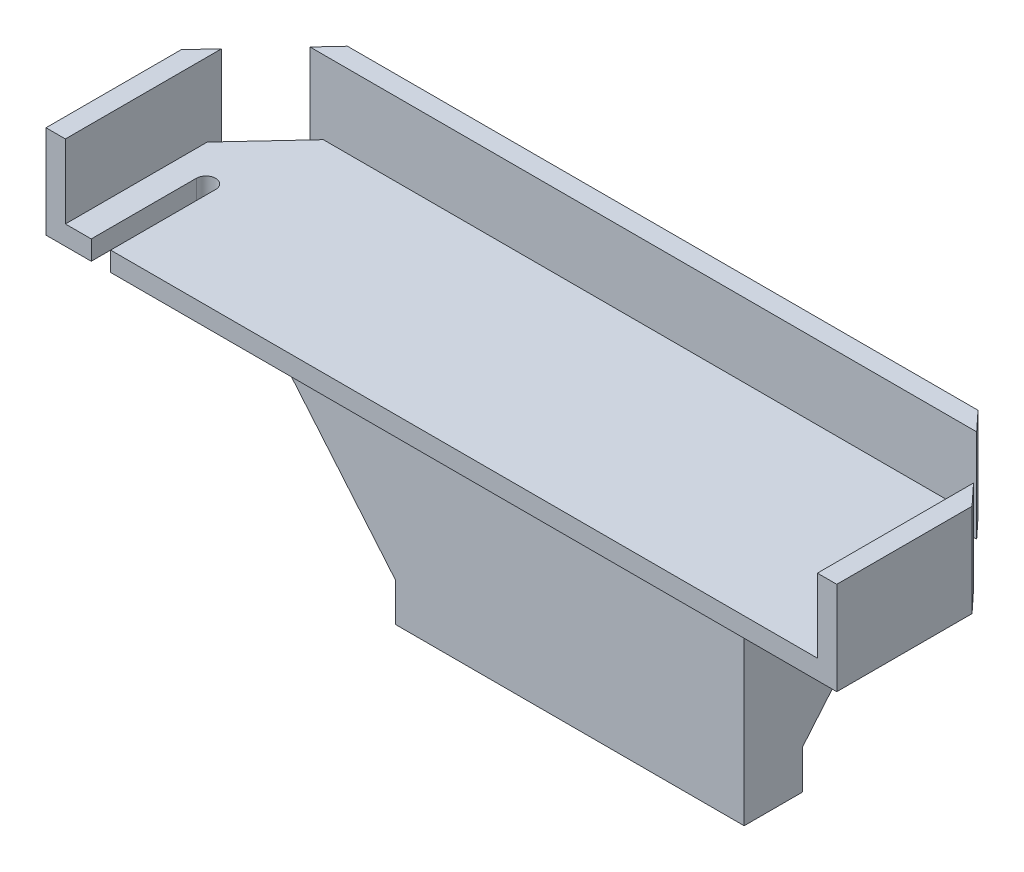
ISO-10303-21;
HEADER;
FILE_DESCRIPTION(('STEP AP214'),'2;1');
FILE_NAME('part.step','',(''),(''),'','','');
FILE_SCHEMA(('AUTOMOTIVE_DESIGN { 1 0 10303 214 1 1 1 1 }'));
ENDSEC;
DATA;
#1=APPLICATION_CONTEXT('core data for automotive mechanical design processes');
#2=APPLICATION_PROTOCOL_DEFINITION('international standard','automotive_design',2000,#1);
#3=PRODUCT_CONTEXT('',#1,'mechanical');
#4=PRODUCT('Part','Part','',(#3));
#5=PRODUCT_RELATED_PRODUCT_CATEGORY('part','',(#4));
#6=PRODUCT_DEFINITION_FORMATION('','',#4);
#7=PRODUCT_DEFINITION_CONTEXT('part definition',#1,'design');
#8=PRODUCT_DEFINITION('design','',#6,#7);
#9=PRODUCT_DEFINITION_SHAPE('','',#8);
#10=(LENGTH_UNIT() NAMED_UNIT(*) SI_UNIT(.MILLI.,.METRE.));
#11=(NAMED_UNIT(*) PLANE_ANGLE_UNIT() SI_UNIT($,.RADIAN.));
#12=(NAMED_UNIT(*) SI_UNIT($,.STERADIAN.) SOLID_ANGLE_UNIT());
#13=UNCERTAINTY_MEASURE_WITH_UNIT(LENGTH_MEASURE(1.E-05),#10,'distance_accuracy_value','');
#14=(GEOMETRIC_REPRESENTATION_CONTEXT(3) GLOBAL_UNCERTAINTY_ASSIGNED_CONTEXT((#13)) GLOBAL_UNIT_ASSIGNED_CONTEXT((#10,
#11,#12)) REPRESENTATION_CONTEXT('',''));
#15=CARTESIAN_POINT('',(0.,0.,0.));
#16=DIRECTION('',(0.,0.,1.));
#17=DIRECTION('',(1.,0.,0.));
#18=AXIS2_PLACEMENT_3D('',#15,#16,#17);
#19=CARTESIAN_POINT('',(0.,13.8,0.));
#20=DIRECTION('',(0.,-1.,0.));
#21=DIRECTION('',(0.,0.,-1.));
#22=AXIS2_PLACEMENT_3D('',#19,#20,#21);
#23=PLANE('',#22);
#24=DIRECTION('',(0.,0.,1.));
#25=VECTOR('',#24,1.);
#26=CARTESIAN_POINT('',(-20.4,13.8,-4.85803199153785));
#27=LINE('',#26,#25);
#28=CARTESIAN_POINT('',(-20.4,13.8,-4.85803199153785));
#29=VERTEX_POINT('',#28);
#30=CARTESIAN_POINT('',(-20.4,13.8,2.12010259286792));
#31=VERTEX_POINT('',#30);
#32=EDGE_CURVE('E283',#29,#31,#27,.T.);
#33=ORIENTED_EDGE('',*,*,#32,.T.);
#34=DIRECTION('',(-1.,0.,0.));
#35=VECTOR('',#34,1.);
#36=CARTESIAN_POINT('',(-20.4,13.8,2.12010259286792));
#37=LINE('',#36,#35);
#38=CARTESIAN_POINT('',(-19.4,13.8,2.12010259286792));
#39=VERTEX_POINT('',#38);
#40=EDGE_CURVE('E242',#39,#31,#37,.T.);
#41=ORIENTED_EDGE('',*,*,#40,.F.);
#42=DIRECTION('',(0.,0.,1.));
#43=VECTOR('',#42,1.);
#44=CARTESIAN_POINT('',(-19.4,13.8,0.));
#45=LINE('',#44,#43);
#46=CARTESIAN_POINT('',(-19.4,13.8,-5.93234821689864));
#47=VERTEX_POINT('',#46);
#48=EDGE_CURVE('E432',#47,#39,#45,.T.);
#49=ORIENTED_EDGE('',*,*,#48,.F.);
#50=DIRECTION('',(-0.681336240562654,0.,0.731970578162777));
#51=VECTOR('',#50,1.);
#52=CARTESIAN_POINT('',(-16.2653067843498,13.8,-9.3));
#53=LINE('',#52,#51);
#54=EDGE_CURVE('E454',#47,#29,#53,.T.);
#55=ORIENTED_EDGE('',*,*,#54,.T.);
#56=EDGE_LOOP('',(#33,#41,#49,#55));
#57=FACE_BOUND('',#56,.T.);
#58=ADVANCED_FACE('F63',(#57),#23,.F.);
#59=CARTESIAN_POINT('',(-16.2653067843498,13.8,-9.3));
#60=VERTEX_POINT('',#59);
#61=CARTESIAN_POINT('',(-17.1961314115811,13.8,-8.3));
#62=VERTEX_POINT('',#61);
#63=EDGE_CURVE('E455',#60,#62,#53,.T.);
#64=ORIENTED_EDGE('',*,*,#63,.T.);
#65=DIRECTION('',(-1.,0.,0.));
#66=VECTOR('',#65,1.);
#67=CARTESIAN_POINT('',(0.,13.8,-8.3));
#68=LINE('',#67,#66);
#69=CARTESIAN_POINT('',(17.1961314115811,13.8,-8.30000000000001));
#70=VERTEX_POINT('',#69);
#71=EDGE_CURVE('E436',#70,#62,#68,.T.);
#72=ORIENTED_EDGE('',*,*,#71,.F.);
#73=DIRECTION('',(-0.681336240562654,0.,-0.731970578162776));
#74=VECTOR('',#73,1.);
#75=CARTESIAN_POINT('',(16.2653067843498,13.8,-9.30000000000001));
#76=LINE('',#75,#74);
#77=CARTESIAN_POINT('',(16.2653067843498,13.8,-9.30000000000001));
#78=VERTEX_POINT('',#77);
#79=EDGE_CURVE('E273',#70,#78,#76,.T.);
#80=ORIENTED_EDGE('',*,*,#79,.T.);
#81=DIRECTION('',(-1.,0.,0.));
#82=VECTOR('',#81,1.);
#83=CARTESIAN_POINT('',(-16.2653067843498,13.8,-9.3));
#84=LINE('',#83,#82);
#85=EDGE_CURVE('E451',#78,#60,#84,.T.);
#86=ORIENTED_EDGE('',*,*,#85,.T.);
#87=EDGE_LOOP('',(#64,#72,#80,#86));
#88=FACE_BOUND('',#87,.T.);
#89=ADVANCED_FACE('F386',(#88),#23,.F.);
#90=CARTESIAN_POINT('',(16.2653067843498,13.8,-9.30000000000001));
#91=DIRECTION('',(-0.731970578162776,0.,0.681336240562654));
#92=DIRECTION('',(0.681336240562654,0.,0.731970578162777));
#93=AXIS2_PLACEMENT_3D('',#90,#91,#92);
#94=PLANE('',#93);
#95=ORIENTED_EDGE('',*,*,#79,.F.);
#96=DIRECTION('',(0.,-1.,0.));
#97=VECTOR('',#96,1.);
#98=CARTESIAN_POINT('',(17.1961314115811,13.8,-8.30000000000001));
#99=LINE('',#98,#97);
#100=CARTESIAN_POINT('',(17.1961314115811,9.,-8.30000000000001));
#101=VERTEX_POINT('',#100);
#102=EDGE_CURVE('E502',#70,#101,#99,.T.);
#103=ORIENTED_EDGE('',*,*,#102,.T.);
#104=DIRECTION('',(-0.681336240562654,0.,-0.731970578162776));
#105=VECTOR('',#104,1.);
#106=CARTESIAN_POINT('',(16.2653067843498,9.,-9.30000000000001));
#107=LINE('',#106,#105);
#108=CARTESIAN_POINT('',(16.2653067843498,9.,-9.30000000000001));
#109=VERTEX_POINT('',#108);
#110=EDGE_CURVE('E463',#101,#109,#107,.T.);
#111=ORIENTED_EDGE('',*,*,#110,.T.);
#112=DIRECTION('',(0.,-1.,0.));
#113=VECTOR('',#112,1.);
#114=CARTESIAN_POINT('',(16.2653067843498,13.8,-9.30000000000001));
#115=LINE('',#114,#113);
#116=EDGE_CURVE('E287',#78,#109,#115,.T.);
#117=ORIENTED_EDGE('',*,*,#116,.F.);
#118=EDGE_LOOP('',(#95,#103,#111,#117));
#119=FACE_BOUND('',#118,.T.);
#120=ADVANCED_FACE('F380',(#119),#94,.F.);
#121=CARTESIAN_POINT('',(-16.2653067843498,13.8,-9.3));
#122=DIRECTION('',(0.731970578162777,0.,0.681336240562654));
#123=DIRECTION('',(0.681336240562654,0.,-0.731970578162777));
#124=AXIS2_PLACEMENT_3D('',#121,#122,#123);
#125=PLANE('',#124);
#126=ORIENTED_EDGE('',*,*,#54,.F.);
#127=DIRECTION('',(0.,-1.,0.));
#128=VECTOR('',#127,1.);
#129=CARTESIAN_POINT('',(-19.4,13.8,-5.93234821689864));
#130=LINE('',#129,#128);
#131=CARTESIAN_POINT('',(-19.4,9.,-5.93234821689864));
#132=VERTEX_POINT('',#131);
#133=EDGE_CURVE('E480',#47,#132,#130,.T.);
#134=ORIENTED_EDGE('',*,*,#133,.T.);
#135=DIRECTION('',(-0.681336240562654,0.,0.731970578162777));
#136=VECTOR('',#135,1.);
#137=CARTESIAN_POINT('',(-16.2653067843498,9.,-9.3));
#138=LINE('',#137,#136);
#139=CARTESIAN_POINT('',(-20.4,9.,-4.85803199153785));
#140=VERTEX_POINT('',#139);
#141=EDGE_CURVE('E276',#132,#140,#138,.T.);
#142=ORIENTED_EDGE('',*,*,#141,.T.);
#143=DIRECTION('',(0.,-1.,0.));
#144=VECTOR('',#143,1.);
#145=CARTESIAN_POINT('',(-20.4,13.8,-4.85803199153785));
#146=LINE('',#145,#144);
#147=EDGE_CURVE('E265',#29,#140,#146,.T.);
#148=ORIENTED_EDGE('',*,*,#147,.F.);
#149=EDGE_LOOP('',(#126,#134,#142,#148));
#150=FACE_BOUND('',#149,.T.);
#151=ADVANCED_FACE('F478',(#150),#125,.F.);
#152=CARTESIAN_POINT('',(20.4,13.8,-4.85803199153786));
#153=DIRECTION('',(-1.,0.,0.));
#154=DIRECTION('',(0.,0.,1.));
#155=AXIS2_PLACEMENT_3D('',#152,#153,#154);
#156=PLANE('',#155);
#157=DIRECTION('',(0.,0.,-1.));
#158=VECTOR('',#157,1.);
#159=CARTESIAN_POINT('',(20.4,13.8,-4.85803199153786));
#160=LINE('',#159,#158);
#161=CARTESIAN_POINT('',(20.4,13.8,2.12010259286792));
#162=VERTEX_POINT('',#161);
#163=CARTESIAN_POINT('',(20.4,13.8,-4.85803199153786));
#164=VERTEX_POINT('',#163);
#165=EDGE_CURVE('E267',#162,#164,#160,.T.);
#166=ORIENTED_EDGE('',*,*,#165,.F.);
#167=DIRECTION('',(0.,1.,0.));
#168=VECTOR('',#167,1.);
#169=CARTESIAN_POINT('',(20.4,9.,2.12010259286792));
#170=LINE('',#169,#168);
#171=CARTESIAN_POINT('',(20.4,9.,2.12010259286792));
#172=VERTEX_POINT('',#171);
#173=EDGE_CURVE('E260',#172,#162,#170,.T.);
#174=ORIENTED_EDGE('',*,*,#173,.F.);
#175=DIRECTION('',(0.,0.,-1.));
#176=VECTOR('',#175,1.);
#177=CARTESIAN_POINT('',(20.4,9.,-4.85803199153786));
#178=LINE('',#177,#176);
#179=CARTESIAN_POINT('',(20.4,9.,-4.85803199153786));
#180=VERTEX_POINT('',#179);
#181=EDGE_CURVE('E423',#172,#180,#178,.T.);
#182=ORIENTED_EDGE('',*,*,#181,.T.);
#183=DIRECTION('',(0.,-1.,0.));
#184=VECTOR('',#183,1.);
#185=CARTESIAN_POINT('',(20.4,13.8,-4.85803199153786));
#186=LINE('',#185,#184);
#187=EDGE_CURVE('E291',#164,#180,#186,.T.);
#188=ORIENTED_EDGE('',*,*,#187,.F.);
#189=EDGE_LOOP('',(#166,#174,#182,#188));
#190=FACE_BOUND('',#189,.T.);
#191=ADVANCED_FACE('F402',(#190),#156,.F.);
#192=CARTESIAN_POINT('',(-20.4,13.8,-4.85803199153785));
#193=DIRECTION('',(1.,0.,0.));
#194=DIRECTION('',(0.,0.,-1.));
#195=AXIS2_PLACEMENT_3D('',#192,#193,#194);
#196=PLANE('',#195);
#197=DIRECTION('',(0.,0.,1.));
#198=VECTOR('',#197,1.);
#199=CARTESIAN_POINT('',(-20.4,9.,-4.85803199153785));
#200=LINE('',#199,#198);
#201=CARTESIAN_POINT('',(-20.4,9.,2.12010259286792));
#202=VERTEX_POINT('',#201);
#203=EDGE_CURVE('E256',#140,#202,#200,.T.);
#204=ORIENTED_EDGE('',*,*,#203,.T.);
#205=DIRECTION('',(0.,-1.,0.));
#206=VECTOR('',#205,1.);
#207=CARTESIAN_POINT('',(-20.4,9.,2.12010259286792));
#208=LINE('',#207,#206);
#209=EDGE_CURVE('E236',#31,#202,#208,.T.);
#210=ORIENTED_EDGE('',*,*,#209,.F.);
#211=ORIENTED_EDGE('',*,*,#32,.F.);
#212=ORIENTED_EDGE('',*,*,#147,.T.);
#213=EDGE_LOOP('',(#204,#210,#211,#212));
#214=FACE_BOUND('',#213,.T.);
#215=ADVANCED_FACE('F263',(#214),#196,.F.);
#216=DIRECTION('',(0.,0.,1.));
#217=VECTOR('',#216,1.);
#218=CARTESIAN_POINT('',(19.4,13.8,0.));
#219=LINE('',#218,#217);
#220=CARTESIAN_POINT('',(19.4,13.8,-5.93234821689864));
#221=VERTEX_POINT('',#220);
#222=CARTESIAN_POINT('',(19.4,13.8,2.12010259286792));
#223=VERTEX_POINT('',#222);
#224=EDGE_CURVE('E407',#221,#223,#219,.T.);
#225=ORIENTED_EDGE('',*,*,#224,.T.);
#226=EDGE_CURVE('E408',#162,#223,#37,.T.);
#227=ORIENTED_EDGE('',*,*,#226,.F.);
#228=ORIENTED_EDGE('',*,*,#165,.T.);
#229=EDGE_CURVE('E411',#164,#221,#76,.T.);
#230=ORIENTED_EDGE('',*,*,#229,.T.);
#231=EDGE_LOOP('',(#225,#227,#228,#230));
#232=FACE_BOUND('',#231,.T.);
#233=ADVANCED_FACE('F389',(#232),#23,.F.);
#234=CARTESIAN_POINT('',(0.,9.,0.));
#235=DIRECTION('',(0.,-1.,0.));
#236=DIRECTION('',(0.,0.,-1.));
#237=AXIS2_PLACEMENT_3D('',#234,#235,#236);
#238=PLANE('',#237);
#239=DIRECTION('',(1.,0.,0.));
#240=VECTOR('',#239,1.);
#241=CARTESIAN_POINT('',(-20.4,9.,2.12010259286792));
#242=LINE('',#241,#240);
#243=CARTESIAN_POINT('',(-18.0653704380586,9.,2.12010259286792));
#244=VERTEX_POINT('',#243);
#245=EDGE_CURVE('E239',#202,#244,#242,.T.);
#246=ORIENTED_EDGE('',*,*,#245,.F.);
#247=ORIENTED_EDGE('',*,*,#203,.F.);
#248=ORIENTED_EDGE('',*,*,#141,.F.);
#249=DIRECTION('',(0.,0.,-1.));
#250=VECTOR('',#249,1.);
#251=CARTESIAN_POINT('',(-19.4,9.,0.));
#252=LINE('',#251,#250);
#253=CARTESIAN_POINT('',(-19.4,9.,-5.19849616231382));
#254=VERTEX_POINT('',#253);
#255=EDGE_CURVE('E430',#254,#132,#252,.T.);
#256=ORIENTED_EDGE('',*,*,#255,.F.);
#257=DIRECTION('',(-0.681336240562654,0.,0.731970578162777));
#258=VECTOR('',#257,1.);
#259=CARTESIAN_POINT('',(-12.9867340245201,9.,-12.0883718573261));
#260=LINE('',#259,#258);
#261=CARTESIAN_POINT('',(-16.5130438464293,9.,-8.3));
#262=VERTEX_POINT('',#261);
#263=EDGE_CURVE('E484',#262,#254,#260,.T.);
#264=ORIENTED_EDGE('',*,*,#263,.F.);
#265=DIRECTION('',(1.,0.,0.));
#266=VECTOR('',#265,1.);
#267=CARTESIAN_POINT('',(0.,9.,-8.3));
#268=LINE('',#267,#266);
#269=CARTESIAN_POINT('',(-17.1961314115811,9.,-8.3));
#270=VERTEX_POINT('',#269);
#271=EDGE_CURVE('E490',#270,#262,#268,.T.);
#272=ORIENTED_EDGE('',*,*,#271,.F.);
#273=CARTESIAN_POINT('',(-16.2653067843498,9.,-9.3));
#274=VERTEX_POINT('',#273);
#275=EDGE_CURVE('E268',#274,#270,#138,.T.);
#276=ORIENTED_EDGE('',*,*,#275,.F.);
#277=DIRECTION('',(-1.,0.,0.));
#278=VECTOR('',#277,1.);
#279=CARTESIAN_POINT('',(-16.2653067843498,9.,-9.3));
#280=LINE('',#279,#278);
#281=EDGE_CURVE('E467',#109,#274,#280,.T.);
#282=ORIENTED_EDGE('',*,*,#281,.F.);
#283=ORIENTED_EDGE('',*,*,#110,.F.);
#284=DIRECTION('',(1.,0.,0.));
#285=VECTOR('',#284,1.);
#286=CARTESIAN_POINT('',(0.,9.,-8.3));
#287=LINE('',#286,#285);
#288=CARTESIAN_POINT('',(16.5130438464293,9.,-8.30000000000001));
#289=VERTEX_POINT('',#288);
#290=EDGE_CURVE('E499',#289,#101,#287,.T.);
#291=ORIENTED_EDGE('',*,*,#290,.F.);
#292=DIRECTION('',(-0.681336240562654,0.,-0.731970578162777));
#293=VECTOR('',#292,1.);
#294=CARTESIAN_POINT('',(12.9867340245201,9.,-12.0883718573261));
#295=LINE('',#294,#293);
#296=CARTESIAN_POINT('',(19.4,9.,-5.19849616231382));
#297=VERTEX_POINT('',#296);
#298=EDGE_CURVE('E514',#297,#289,#295,.T.);
#299=ORIENTED_EDGE('',*,*,#298,.F.);
#300=DIRECTION('',(0.,0.,1.));
#301=VECTOR('',#300,1.);
#302=CARTESIAN_POINT('',(19.4,9.,0.));
#303=LINE('',#302,#301);
#304=CARTESIAN_POINT('',(19.4,9.,-5.93234821689864));
#305=VERTEX_POINT('',#304);
#306=EDGE_CURVE('E506',#305,#297,#303,.T.);
#307=ORIENTED_EDGE('',*,*,#306,.F.);
#308=EDGE_CURVE('E464',#180,#305,#107,.T.);
#309=ORIENTED_EDGE('',*,*,#308,.F.);
#310=ORIENTED_EDGE('',*,*,#181,.F.);
#311=CARTESIAN_POINT('',(-17.0653704380586,9.,2.12010259286792));
#312=VERTEX_POINT('',#311);
#313=EDGE_CURVE('E248',#312,#172,#242,.T.);
#314=ORIENTED_EDGE('',*,*,#313,.F.);
#315=DIRECTION('',(0.,0.,1.));
#316=VECTOR('',#315,1.);
#317=CARTESIAN_POINT('',(-17.0653704380586,9.,0.));
#318=LINE('',#317,#316);
#319=CARTESIAN_POINT('',(-17.0653704380586,9.,-3.30000000000001));
#320=VERTEX_POINT('',#319);
#321=EDGE_CURVE('E533',#320,#312,#318,.T.);
#322=ORIENTED_EDGE('',*,*,#321,.F.);
#323=CARTESIAN_POINT('',(-17.5653704380585,9.,-3.30000000000001));
#324=DIRECTION('',(0.,-1.,0.));
#325=DIRECTION('',(0.,0.,-1.));
#326=AXIS2_PLACEMENT_3D('',#323,#324,#325);
#327=CIRCLE('',#326,0.5);
#328=CARTESIAN_POINT('',(-18.0653704380586,9.,-3.30000000000001));
#329=VERTEX_POINT('',#328);
#330=EDGE_CURVE('E522',#329,#320,#327,.T.);
#331=ORIENTED_EDGE('',*,*,#330,.F.);
#332=DIRECTION('',(0.,0.,-1.));
#333=VECTOR('',#332,1.);
#334=CARTESIAN_POINT('',(-18.0653704380586,9.,0.));
#335=LINE('',#334,#333);
#336=EDGE_CURVE('E258',#244,#329,#335,.T.);
#337=ORIENTED_EDGE('',*,*,#336,.F.);
#338=EDGE_LOOP('',(#246,#247,#248,#256,#264,#272,#276,#282,#283,#291,#299,#307,#309,#310,#314,
#322,#331,#337));
#339=FACE_BOUND('',#338,.T.);
#340=DIRECTION('',(0.,0.,1.));
#341=VECTOR('',#340,1.);
#342=CARTESIAN_POINT('',(-8.87369741824106,9.,1.5));
#343=LINE('',#342,#341);
#344=CARTESIAN_POINT('',(-8.87369741824106,9.,-7.37369741824106));
#345=VERTEX_POINT('',#344);
#346=CARTESIAN_POINT('',(-8.87369741824106,9.,1.5));
#347=VERTEX_POINT('',#346);
#348=EDGE_CURVE('E339',#345,#347,#343,.T.);
#349=ORIENTED_EDGE('',*,*,#348,.T.);
#350=DIRECTION('',(1.,0.,0.));
#351=VECTOR('',#350,1.);
#352=CARTESIAN_POINT('',(0.,9.,1.5));
#353=LINE('',#352,#351);
#354=CARTESIAN_POINT('',(15.,9.,1.5));
#355=VERTEX_POINT('',#354);
#356=EDGE_CURVE('E89',#347,#355,#353,.T.);
#357=ORIENTED_EDGE('',*,*,#356,.T.);
#358=DIRECTION('',(0.,0.,-1.));
#359=VECTOR('',#358,1.);
#360=CARTESIAN_POINT('',(15.,9.,0.));
#361=LINE('',#360,#359);
#362=CARTESIAN_POINT('',(15.,9.,-7.37369741824106));
#363=VERTEX_POINT('',#362);
#364=EDGE_CURVE('E298',#355,#363,#361,.T.);
#365=ORIENTED_EDGE('',*,*,#364,.T.);
#366=DIRECTION('',(-1.,0.,0.));
#367=VECTOR('',#366,1.);
#368=CARTESIAN_POINT('',(-3.,9.,-7.37369741824106));
#369=LINE('',#368,#367);
#370=EDGE_CURVE('E336',#363,#345,#369,.T.);
#371=ORIENTED_EDGE('',*,*,#370,.T.);
#372=EDGE_LOOP('',(#349,#357,#365,#371));
#373=FACE_BOUND('',#372,.T.);
#374=ADVANCED_FACE('F253',(#339,#373),#238,.T.);
#375=CARTESIAN_POINT('',(0.,9.,1.5));
#376=DIRECTION('',(0.,0.,-1.));
#377=DIRECTION('',(-1.,0.,0.));
#378=AXIS2_PLACEMENT_3D('',#375,#376,#377);
#379=PLANE('',#378);
#380=DIRECTION('',(1.,0.,0.));
#381=VECTOR('',#380,1.);
#382=CARTESIAN_POINT('',(0.,0.,1.5));
#383=LINE('',#382,#381);
#384=CARTESIAN_POINT('',(-3.,0.,1.5));
#385=VERTEX_POINT('',#384);
#386=CARTESIAN_POINT('',(15.,0.,1.5));
#387=VERTEX_POINT('',#386);
#388=EDGE_CURVE('E295',#385,#387,#383,.T.);
#389=ORIENTED_EDGE('',*,*,#388,.T.);
#390=DIRECTION('',(0.,-1.,0.));
#391=VECTOR('',#390,1.);
#392=CARTESIAN_POINT('',(15.,9.,1.5));
#393=LINE('',#392,#391);
#394=EDGE_CURVE('E325',#355,#387,#393,.T.);
#395=ORIENTED_EDGE('',*,*,#394,.F.);
#396=ORIENTED_EDGE('',*,*,#356,.F.);
#397=DIRECTION('',(-0.642787609686544,0.766044443118974,0.));
#398=VECTOR('',#397,1.);
#399=CARTESIAN_POINT('',(-5.20729940204313,4.63055699231589,1.5));
#400=LINE('',#399,#398);
#401=CARTESIAN_POINT('',(-3.,1.99999999999996,1.5));
#402=VERTEX_POINT('',#401);
#403=EDGE_CURVE('E74',#347,#402,#400,.F.);
#404=ORIENTED_EDGE('',*,*,#403,.T.);
#405=DIRECTION('',(0.,-1.,0.));
#406=VECTOR('',#405,1.);
#407=CARTESIAN_POINT('',(-3.,9.,1.5));
#408=LINE('',#407,#406);
#409=EDGE_CURVE('E302',#402,#385,#408,.T.);
#410=ORIENTED_EDGE('',*,*,#409,.T.);
#411=EDGE_LOOP('',(#389,#395,#396,#404,#410));
#412=FACE_BOUND('',#411,.T.);
#413=ADVANCED_FACE('F348',(#412),#379,.F.);
#414=CARTESIAN_POINT('',(15.,9.,0.));
#415=DIRECTION('',(-1.,0.,0.));
#416=DIRECTION('',(0.,0.,1.));
#417=AXIS2_PLACEMENT_3D('',#414,#415,#416);
#418=PLANE('',#417);
#419=DIRECTION('',(0.,0.,-1.));
#420=VECTOR('',#419,1.);
#421=CARTESIAN_POINT('',(15.,0.,0.));
#422=LINE('',#421,#420);
#423=CARTESIAN_POINT('',(15.,0.,-1.5));
#424=VERTEX_POINT('',#423);
#425=EDGE_CURVE('E306',#387,#424,#422,.T.);
#426=ORIENTED_EDGE('',*,*,#425,.T.);
#427=DIRECTION('',(0.,-1.,0.));
#428=VECTOR('',#427,1.);
#429=CARTESIAN_POINT('',(15.,9.,-1.5));
#430=LINE('',#429,#428);
#431=CARTESIAN_POINT('',(15.,1.99999999999996,-1.5));
#432=VERTEX_POINT('',#431);
#433=EDGE_CURVE('E322',#432,#424,#430,.T.);
#434=ORIENTED_EDGE('',*,*,#433,.F.);
#435=DIRECTION('',(0.,-0.766044443118974,0.642787609686544));
#436=VECTOR('',#435,1.);
#437=CARTESIAN_POINT('',(15.,5.36916280707504,-4.32706326879295));
#438=LINE('',#437,#436);
#439=EDGE_CURVE('E14',#432,#363,#438,.F.);
#440=ORIENTED_EDGE('',*,*,#439,.T.);
#441=ORIENTED_EDGE('',*,*,#364,.F.);
#442=ORIENTED_EDGE('',*,*,#394,.T.);
#443=EDGE_LOOP('',(#426,#434,#440,#441,#442));
#444=FACE_BOUND('',#443,.T.);
#445=ADVANCED_FACE('F364',(#444),#418,.F.);
#446=CARTESIAN_POINT('',(0.,9.,-1.5));
#447=DIRECTION('',(0.,0.,-1.));
#448=DIRECTION('',(-1.,0.,0.));
#449=AXIS2_PLACEMENT_3D('',#446,#447,#448);
#450=PLANE('',#449);
#451=DIRECTION('',(0.,-1.,0.));
#452=VECTOR('',#451,1.);
#453=CARTESIAN_POINT('',(-3.,9.,-1.5));
#454=LINE('',#453,#452);
#455=CARTESIAN_POINT('',(-3.,1.99999999999996,-1.5));
#456=VERTEX_POINT('',#455);
#457=CARTESIAN_POINT('',(-3.,0.,-1.5));
#458=VERTEX_POINT('',#457);
#459=EDGE_CURVE('E319',#456,#458,#454,.T.);
#460=ORIENTED_EDGE('',*,*,#459,.F.);
#461=DIRECTION('',(1.,0.,0.));
#462=VECTOR('',#461,1.);
#463=CARTESIAN_POINT('',(15.,1.99999999999996,-1.5));
#464=LINE('',#463,#462);
#465=EDGE_CURVE('E81',#456,#432,#464,.T.);
#466=ORIENTED_EDGE('',*,*,#465,.T.);
#467=ORIENTED_EDGE('',*,*,#433,.T.);
#468=DIRECTION('',(1.,0.,0.));
#469=VECTOR('',#468,1.);
#470=CARTESIAN_POINT('',(0.,0.,-1.5));
#471=LINE('',#470,#469);
#472=EDGE_CURVE('E310',#458,#424,#471,.T.);
#473=ORIENTED_EDGE('',*,*,#472,.F.);
#474=EDGE_LOOP('',(#460,#466,#467,#473));
#475=FACE_BOUND('',#474,.T.);
#476=ADVANCED_FACE('F366',(#475),#450,.T.);
#477=CARTESIAN_POINT('',(-3.,9.,0.));
#478=DIRECTION('',(-1.,0.,0.));
#479=DIRECTION('',(0.,0.,1.));
#480=AXIS2_PLACEMENT_3D('',#477,#478,#479);
#481=PLANE('',#480);
#482=ORIENTED_EDGE('',*,*,#409,.F.);
#483=DIRECTION('',(0.,0.,-1.));
#484=VECTOR('',#483,1.);
#485=CARTESIAN_POINT('',(-3.,1.99999999999996,-1.5));
#486=LINE('',#485,#484);
#487=EDGE_CURVE('E332',#402,#456,#486,.T.);
#488=ORIENTED_EDGE('',*,*,#487,.T.);
#489=ORIENTED_EDGE('',*,*,#459,.T.);
#490=DIRECTION('',(0.,0.,-1.));
#491=VECTOR('',#490,1.);
#492=CARTESIAN_POINT('',(-3.,0.,0.));
#493=LINE('',#492,#491);
#494=EDGE_CURVE('E299',#385,#458,#493,.T.);
#495=ORIENTED_EDGE('',*,*,#494,.F.);
#496=EDGE_LOOP('',(#482,#488,#489,#495));
#497=FACE_BOUND('',#496,.T.);
#498=ADVANCED_FACE('F355',(#497),#481,.T.);
#499=CARTESIAN_POINT('',(0.,0.,0.));
#500=DIRECTION('',(0.,1.,0.));
#501=DIRECTION('',(0.,0.,1.));
#502=AXIS2_PLACEMENT_3D('',#499,#500,#501);
#503=PLANE('',#502);
#504=CARTESIAN_POINT('',(2.91546981112509,0.,0.));
#505=DIRECTION('',(0.,-1.,0.));
#506=DIRECTION('',(0.,0.,-1.));
#507=AXIS2_PLACEMENT_3D('',#504,#505,#506);
#508=CIRCLE('',#507,1.);
#509=CARTESIAN_POINT('',(2.91546981112509,0.,-1.));
#510=VERTEX_POINT('',#509);
#511=EDGE_CURVE('E567',#510,#510,#508,.T.);
#512=ORIENTED_EDGE('',*,*,#511,.F.);
#513=EDGE_LOOP('',(#512));
#514=FACE_BOUND('',#513,.T.);
#515=CARTESIAN_POINT('',(7.08453018887491,0.,0.));
#516=DIRECTION('',(0.,-1.,0.));
#517=DIRECTION('',(0.,0.,1.));
#518=AXIS2_PLACEMENT_3D('',#515,#516,#517);
#519=CIRCLE('',#518,1.);
#520=CARTESIAN_POINT('',(7.08453018887491,0.,1.));
#521=VERTEX_POINT('',#520);
#522=EDGE_CURVE('E558',#521,#521,#519,.T.);
#523=ORIENTED_EDGE('',*,*,#522,.F.);
#524=EDGE_LOOP('',(#523));
#525=FACE_BOUND('',#524,.T.);
#526=ORIENTED_EDGE('',*,*,#388,.F.);
#527=ORIENTED_EDGE('',*,*,#494,.T.);
#528=ORIENTED_EDGE('',*,*,#472,.T.);
#529=ORIENTED_EDGE('',*,*,#425,.F.);
#530=EDGE_LOOP('',(#526,#527,#528,#529));
#531=FACE_BOUND('',#530,.T.);
#532=ADVANCED_FACE('F368',(#514,#525,#531),#503,.F.);
#533=ORIENTED_EDGE('',*,*,#308,.T.);
#534=DIRECTION('',(0.,1.,0.));
#535=VECTOR('',#534,1.);
#536=CARTESIAN_POINT('',(19.4,13.8,-5.93234821689864));
#537=LINE('',#536,#535);
#538=EDGE_CURVE('E509',#305,#221,#537,.T.);
#539=ORIENTED_EDGE('',*,*,#538,.T.);
#540=ORIENTED_EDGE('',*,*,#229,.F.);
#541=ORIENTED_EDGE('',*,*,#187,.T.);
#542=EDGE_LOOP('',(#533,#539,#540,#541));
#543=FACE_BOUND('',#542,.T.);
#544=ADVANCED_FACE('F370',(#543),#94,.F.);
#545=CARTESIAN_POINT('',(-16.2653067843498,13.8,-9.3));
#546=DIRECTION('',(0.,0.,1.));
#547=DIRECTION('',(1.,0.,0.));
#548=AXIS2_PLACEMENT_3D('',#545,#546,#547);
#549=PLANE('',#548);
#550=ORIENTED_EDGE('',*,*,#281,.T.);
#551=DIRECTION('',(0.,-1.,0.));
#552=VECTOR('',#551,1.);
#553=CARTESIAN_POINT('',(-16.2653067843498,13.8,-9.3));
#554=LINE('',#553,#552);
#555=EDGE_CURVE('E282',#60,#274,#554,.T.);
#556=ORIENTED_EDGE('',*,*,#555,.F.);
#557=ORIENTED_EDGE('',*,*,#85,.F.);
#558=ORIENTED_EDGE('',*,*,#116,.T.);
#559=EDGE_LOOP('',(#550,#556,#557,#558));
#560=FACE_BOUND('',#559,.T.);
#561=ADVANCED_FACE('F377',(#560),#549,.F.);
#562=ORIENTED_EDGE('',*,*,#275,.T.);
#563=DIRECTION('',(0.,1.,0.));
#564=VECTOR('',#563,1.);
#565=CARTESIAN_POINT('',(-17.1961314115811,13.8,-8.3));
#566=LINE('',#565,#564);
#567=EDGE_CURVE('E493',#270,#62,#566,.T.);
#568=ORIENTED_EDGE('',*,*,#567,.T.);
#569=ORIENTED_EDGE('',*,*,#63,.F.);
#570=ORIENTED_EDGE('',*,*,#555,.T.);
#571=EDGE_LOOP('',(#562,#568,#569,#570));
#572=FACE_BOUND('',#571,.T.);
#573=ADVANCED_FACE('F689',(#572),#125,.F.);
#574=CARTESIAN_POINT('',(0.,10.,0.));
#575=DIRECTION('',(0.,-1.,0.));
#576=DIRECTION('',(0.,0.,-1.));
#577=AXIS2_PLACEMENT_3D('',#574,#575,#576);
#578=PLANE('',#577);
#579=DIRECTION('',(0.,0.,1.));
#580=VECTOR('',#579,1.);
#581=CARTESIAN_POINT('',(-19.4,10.,0.));
#582=LINE('',#581,#580);
#583=CARTESIAN_POINT('',(-19.4,10.,-5.19849616231382));
#584=VERTEX_POINT('',#583);
#585=CARTESIAN_POINT('',(-19.4,10.,2.12010259286792));
#586=VERTEX_POINT('',#585);
#587=EDGE_CURVE('E417',#584,#586,#582,.T.);
#588=ORIENTED_EDGE('',*,*,#587,.T.);
#589=DIRECTION('',(1.,0.,0.));
#590=VECTOR('',#589,1.);
#591=CARTESIAN_POINT('',(0.,10.,2.12010259286792));
#592=LINE('',#591,#590);
#593=CARTESIAN_POINT('',(-18.0653704380586,10.,2.12010259286792));
#594=VERTEX_POINT('',#593);
#595=EDGE_CURVE('E585',#586,#594,#592,.T.);
#596=ORIENTED_EDGE('',*,*,#595,.T.);
#597=DIRECTION('',(0.,0.,1.));
#598=VECTOR('',#597,1.);
#599=CARTESIAN_POINT('',(-18.0653704380586,10.,4.99263053926631));
#600=LINE('',#599,#598);
#601=CARTESIAN_POINT('',(-18.0653704380586,10.,-3.30000000000001));
#602=VERTEX_POINT('',#601);
#603=EDGE_CURVE('E549',#602,#594,#600,.T.);
#604=ORIENTED_EDGE('',*,*,#603,.F.);
#605=CARTESIAN_POINT('',(-17.5653704380585,10.,-3.30000000000001));
#606=DIRECTION('',(0.,1.,0.));
#607=DIRECTION('',(0.,0.,-1.));
#608=AXIS2_PLACEMENT_3D('',#605,#606,#607);
#609=CIRCLE('',#608,0.5);
#610=CARTESIAN_POINT('',(-17.0653704380586,10.,-3.30000000000001));
#611=VERTEX_POINT('',#610);
#612=EDGE_CURVE('E553',#611,#602,#609,.T.);
#613=ORIENTED_EDGE('',*,*,#612,.F.);
#614=DIRECTION('',(0.,0.,-1.));
#615=VECTOR('',#614,1.);
#616=CARTESIAN_POINT('',(-17.0653704380586,10.,-3.30000000000001));
#617=LINE('',#616,#615);
#618=CARTESIAN_POINT('',(-17.0653704380586,10.,2.12010259286792));
#619=VERTEX_POINT('',#618);
#620=EDGE_CURVE('E543',#619,#611,#617,.T.);
#621=ORIENTED_EDGE('',*,*,#620,.F.);
#622=CARTESIAN_POINT('',(19.4,10.,2.12010259286792));
#623=VERTEX_POINT('',#622);
#624=EDGE_CURVE('E576',#619,#623,#592,.T.);
#625=ORIENTED_EDGE('',*,*,#624,.T.);
#626=DIRECTION('',(0.,0.,1.));
#627=VECTOR('',#626,1.);
#628=CARTESIAN_POINT('',(19.4,10.,0.));
#629=LINE('',#628,#627);
#630=CARTESIAN_POINT('',(19.4,10.,-5.19849616231382));
#631=VERTEX_POINT('',#630);
#632=EDGE_CURVE('E439',#631,#623,#629,.T.);
#633=ORIENTED_EDGE('',*,*,#632,.F.);
#634=DIRECTION('',(0.681336240562654,0.,0.731970578162777));
#635=VECTOR('',#634,1.);
#636=CARTESIAN_POINT('',(12.9867340245201,10.,-12.0883718573261));
#637=LINE('',#636,#635);
#638=CARTESIAN_POINT('',(16.5130438464293,10.,-8.30000000000001));
#639=VERTEX_POINT('',#638);
#640=EDGE_CURVE('E443',#639,#631,#637,.T.);
#641=ORIENTED_EDGE('',*,*,#640,.F.);
#642=DIRECTION('',(-1.,0.,0.));
#643=VECTOR('',#642,1.);
#644=CARTESIAN_POINT('',(0.,10.,-8.3));
#645=LINE('',#644,#643);
#646=CARTESIAN_POINT('',(-16.5130438464293,10.,-8.3));
#647=VERTEX_POINT('',#646);
#648=EDGE_CURVE('E416',#639,#647,#645,.T.);
#649=ORIENTED_EDGE('',*,*,#648,.T.);
#650=DIRECTION('',(-0.681336240562654,0.,0.731970578162777));
#651=VECTOR('',#650,1.);
#652=CARTESIAN_POINT('',(-12.9867340245201,10.,-12.0883718573261));
#653=LINE('',#652,#651);
#654=EDGE_CURVE('E426',#647,#584,#653,.T.);
#655=ORIENTED_EDGE('',*,*,#654,.T.);
#656=EDGE_LOOP('',(#588,#596,#604,#613,#621,#625,#633,#641,#649,#655));
#657=FACE_BOUND('',#656,.T.);
#658=ADVANCED_FACE('F632',(#657),#578,.F.);
#659=CARTESIAN_POINT('',(-19.4,-31.5897628205006,0.));
#660=DIRECTION('',(-1.,0.,0.));
#661=DIRECTION('',(0.,0.,1.));
#662=AXIS2_PLACEMENT_3D('',#659,#660,#661);
#663=PLANE('',#662);
#664=ORIENTED_EDGE('',*,*,#48,.T.);
#665=DIRECTION('',(0.,-1.,0.));
#666=VECTOR('',#665,1.);
#667=CARTESIAN_POINT('',(-19.4,-31.5897628205006,2.12010259286792));
#668=LINE('',#667,#666);
#669=EDGE_CURVE('E581',#39,#586,#668,.T.);
#670=ORIENTED_EDGE('',*,*,#669,.T.);
#671=ORIENTED_EDGE('',*,*,#587,.F.);
#672=DIRECTION('',(0.,1.,0.));
#673=VECTOR('',#672,1.);
#674=CARTESIAN_POINT('',(-19.4,6.9,-5.19849616231382));
#675=LINE('',#674,#673);
#676=EDGE_CURVE('E517',#254,#584,#675,.T.);
#677=ORIENTED_EDGE('',*,*,#676,.F.);
#678=ORIENTED_EDGE('',*,*,#255,.T.);
#679=ORIENTED_EDGE('',*,*,#133,.F.);
#680=EDGE_LOOP('',(#664,#670,#671,#677,#678,#679));
#681=FACE_BOUND('',#680,.T.);
#682=ADVANCED_FACE('F681',(#681),#663,.F.);
#683=CARTESIAN_POINT('',(19.4,-31.5897628205006,0.));
#684=DIRECTION('',(-1.,0.,0.));
#685=DIRECTION('',(0.,0.,1.));
#686=AXIS2_PLACEMENT_3D('',#683,#684,#685);
#687=PLANE('',#686);
#688=DIRECTION('',(0.,-1.,0.));
#689=VECTOR('',#688,1.);
#690=CARTESIAN_POINT('',(19.4,-31.5897628205006,2.12010259286792));
#691=LINE('',#690,#689);
#692=EDGE_CURVE('E563',#223,#623,#691,.T.);
#693=ORIENTED_EDGE('',*,*,#692,.F.);
#694=ORIENTED_EDGE('',*,*,#224,.F.);
#695=ORIENTED_EDGE('',*,*,#538,.F.);
#696=ORIENTED_EDGE('',*,*,#306,.T.);
#697=DIRECTION('',(0.,1.,0.));
#698=VECTOR('',#697,1.);
#699=CARTESIAN_POINT('',(19.4,6.9,-5.19849616231382));
#700=LINE('',#699,#698);
#701=EDGE_CURVE('E521',#297,#631,#700,.T.);
#702=ORIENTED_EDGE('',*,*,#701,.T.);
#703=ORIENTED_EDGE('',*,*,#632,.T.);
#704=EDGE_LOOP('',(#693,#694,#695,#696,#702,#703));
#705=FACE_BOUND('',#704,.T.);
#706=ADVANCED_FACE('F635',(#705),#687,.T.);
#707=CARTESIAN_POINT('',(0.,-31.5897628205006,-8.3));
#708=DIRECTION('',(0.,0.,-1.));
#709=DIRECTION('',(-1.,0.,0.));
#710=AXIS2_PLACEMENT_3D('',#707,#708,#709);
#711=PLANE('',#710);
#712=ORIENTED_EDGE('',*,*,#648,.F.);
#713=DIRECTION('',(0.,1.,0.));
#714=VECTOR('',#713,1.);
#715=CARTESIAN_POINT('',(16.5130438464293,6.9,-8.30000000000001));
#716=LINE('',#715,#714);
#717=EDGE_CURVE('E518',#289,#639,#716,.T.);
#718=ORIENTED_EDGE('',*,*,#717,.F.);
#719=ORIENTED_EDGE('',*,*,#290,.T.);
#720=ORIENTED_EDGE('',*,*,#102,.F.);
#721=ORIENTED_EDGE('',*,*,#71,.T.);
#722=ORIENTED_EDGE('',*,*,#567,.F.);
#723=ORIENTED_EDGE('',*,*,#271,.T.);
#724=DIRECTION('',(0.,1.,0.));
#725=VECTOR('',#724,1.);
#726=CARTESIAN_POINT('',(-16.5130438464293,6.9,-8.3));
#727=LINE('',#726,#725);
#728=EDGE_CURVE('E526',#262,#647,#727,.T.);
#729=ORIENTED_EDGE('',*,*,#728,.T.);
#730=EDGE_LOOP('',(#712,#718,#719,#720,#721,#722,#723,#729));
#731=FACE_BOUND('',#730,.T.);
#732=ADVANCED_FACE('F648',(#731),#711,.F.);
#733=CARTESIAN_POINT('',(16.5130438464293,6.9,-8.30000000000001));
#734=DIRECTION('',(-0.731970578162777,0.,0.681336240562654));
#735=DIRECTION('',(0.681336240562654,0.,0.731970578162777));
#736=AXIS2_PLACEMENT_3D('',#733,#734,#735);
#737=PLANE('',#736);
#738=ORIENTED_EDGE('',*,*,#298,.T.);
#739=ORIENTED_EDGE('',*,*,#717,.T.);
#740=ORIENTED_EDGE('',*,*,#640,.T.);
#741=ORIENTED_EDGE('',*,*,#701,.F.);
#742=EDGE_LOOP('',(#738,#739,#740,#741));
#743=FACE_BOUND('',#742,.T.);
#744=ADVANCED_FACE('F640',(#743),#737,.F.);
#745=CARTESIAN_POINT('',(-16.5130438464293,6.9,-8.3));
#746=DIRECTION('',(0.731970578162777,0.,0.681336240562654));
#747=DIRECTION('',(0.681336240562654,0.,-0.731970578162777));
#748=AXIS2_PLACEMENT_3D('',#745,#746,#747);
#749=PLANE('',#748);
#750=ORIENTED_EDGE('',*,*,#263,.T.);
#751=ORIENTED_EDGE('',*,*,#676,.T.);
#752=ORIENTED_EDGE('',*,*,#654,.F.);
#753=ORIENTED_EDGE('',*,*,#728,.F.);
#754=EDGE_LOOP('',(#750,#751,#752,#753));
#755=FACE_BOUND('',#754,.T.);
#756=ADVANCED_FACE('F695',(#755),#749,.F.);
#757=CARTESIAN_POINT('',(-17.5653704380585,5.5,-3.30000000000001));
#758=DIRECTION('',(0.,1.,0.));
#759=DIRECTION('',(0.,0.,1.));
#760=AXIS2_PLACEMENT_3D('',#757,#758,#759);
#761=CYLINDRICAL_SURFACE('',#760,0.5);
#762=ORIENTED_EDGE('',*,*,#330,.T.);
#763=DIRECTION('',(0.,1.,0.));
#764=VECTOR('',#763,1.);
#765=CARTESIAN_POINT('',(-17.0653704380586,5.5,-3.30000000000001));
#766=LINE('',#765,#764);
#767=EDGE_CURVE('E539',#320,#611,#766,.T.);
#768=ORIENTED_EDGE('',*,*,#767,.T.);
#769=ORIENTED_EDGE('',*,*,#612,.T.);
#770=DIRECTION('',(0.,1.,0.));
#771=VECTOR('',#770,1.);
#772=CARTESIAN_POINT('',(-18.0653704380586,5.5,-3.30000000000001));
#773=LINE('',#772,#771);
#774=EDGE_CURVE('E540',#329,#602,#773,.T.);
#775=ORIENTED_EDGE('',*,*,#774,.F.);
#776=EDGE_LOOP('',(#762,#768,#769,#775));
#777=FACE_BOUND('',#776,.T.);
#778=ADVANCED_FACE('F698',(#777),#761,.F.);
#779=CARTESIAN_POINT('',(-17.0653704380586,5.5,-3.30000000000001));
#780=DIRECTION('',(1.,0.,0.));
#781=DIRECTION('',(0.,0.,-1.));
#782=AXIS2_PLACEMENT_3D('',#779,#780,#781);
#783=PLANE('',#782);
#784=ORIENTED_EDGE('',*,*,#321,.T.);
#785=DIRECTION('',(0.,1.,0.));
#786=VECTOR('',#785,1.);
#787=CARTESIAN_POINT('',(-17.0653704380586,5.5,2.12010259286792));
#788=LINE('',#787,#786);
#789=EDGE_CURVE('E577',#312,#619,#788,.T.);
#790=ORIENTED_EDGE('',*,*,#789,.T.);
#791=ORIENTED_EDGE('',*,*,#620,.T.);
#792=ORIENTED_EDGE('',*,*,#767,.F.);
#793=EDGE_LOOP('',(#784,#790,#791,#792));
#794=FACE_BOUND('',#793,.T.);
#795=ADVANCED_FACE('F702',(#794),#783,.F.);
#796=CARTESIAN_POINT('',(-18.0653704380586,5.5,4.99263053926631));
#797=DIRECTION('',(-1.,0.,0.));
#798=DIRECTION('',(0.,0.,1.));
#799=AXIS2_PLACEMENT_3D('',#796,#797,#798);
#800=PLANE('',#799);
#801=ORIENTED_EDGE('',*,*,#603,.T.);
#802=DIRECTION('',(0.,-1.,0.));
#803=VECTOR('',#802,1.);
#804=CARTESIAN_POINT('',(-18.0653704380586,5.5,2.12010259286792));
#805=LINE('',#804,#803);
#806=EDGE_CURVE('E329',#594,#244,#805,.T.);
#807=ORIENTED_EDGE('',*,*,#806,.T.);
#808=ORIENTED_EDGE('',*,*,#336,.T.);
#809=ORIENTED_EDGE('',*,*,#774,.T.);
#810=EDGE_LOOP('',(#801,#807,#808,#809));
#811=FACE_BOUND('',#810,.T.);
#812=ADVANCED_FACE('F704',(#811),#800,.F.);
#813=CARTESIAN_POINT('',(7.08453018887491,4.5,0.));
#814=DIRECTION('',(0.,-1.,0.));
#815=DIRECTION('',(0.,0.,-1.));
#816=AXIS2_PLACEMENT_3D('',#813,#814,#815);
#817=CYLINDRICAL_SURFACE('',#816,1.);
#818=CARTESIAN_POINT('',(7.08453018887491,4.5,0.));
#819=DIRECTION('',(0.,-1.,0.));
#820=DIRECTION('',(0.,0.,1.));
#821=AXIS2_PLACEMENT_3D('',#818,#819,#820);
#822=CIRCLE('',#821,1.);
#823=CARTESIAN_POINT('',(7.08453018887491,4.5,1.));
#824=VERTEX_POINT('',#823);
#825=EDGE_CURVE('E562',#824,#824,#822,.T.);
#826=ORIENTED_EDGE('',*,*,#825,.F.);
#827=EDGE_LOOP('',(#826));
#828=FACE_BOUND('',#827,.T.);
#829=ORIENTED_EDGE('',*,*,#522,.T.);
#830=EDGE_LOOP('',(#829));
#831=FACE_BOUND('',#830,.T.);
#832=ADVANCED_FACE('F707',(#828,#831),#817,.F.);
#833=CARTESIAN_POINT('',(7.08453018887491,4.5,0.));
#834=DIRECTION('',(0.,1.,0.));
#835=DIRECTION('',(0.,0.,1.));
#836=AXIS2_PLACEMENT_3D('',#833,#834,#835);
#837=PLANE('',#836);
#838=ORIENTED_EDGE('',*,*,#825,.T.);
#839=EDGE_LOOP('',(#838));
#840=FACE_BOUND('',#839,.T.);
#841=ADVANCED_FACE('F714',(#840),#837,.F.);
#842=CARTESIAN_POINT('',(2.91546981112509,4.5,0.));
#843=DIRECTION('',(0.,-1.,0.));
#844=DIRECTION('',(0.,0.,-1.));
#845=AXIS2_PLACEMENT_3D('',#842,#843,#844);
#846=CYLINDRICAL_SURFACE('',#845,1.);
#847=CARTESIAN_POINT('',(2.91546981112509,4.5,0.));
#848=DIRECTION('',(0.,-1.,0.));
#849=DIRECTION('',(0.,0.,-1.));
#850=AXIS2_PLACEMENT_3D('',#847,#848,#849);
#851=CIRCLE('',#850,1.);
#852=CARTESIAN_POINT('',(2.91546981112509,4.5,-1.));
#853=VERTEX_POINT('',#852);
#854=EDGE_CURVE('E557',#853,#853,#851,.T.);
#855=ORIENTED_EDGE('',*,*,#854,.F.);
#856=EDGE_LOOP('',(#855));
#857=FACE_BOUND('',#856,.T.);
#858=ORIENTED_EDGE('',*,*,#511,.T.);
#859=EDGE_LOOP('',(#858));
#860=FACE_BOUND('',#859,.T.);
#861=ADVANCED_FACE('F718',(#857,#860),#846,.F.);
#862=CARTESIAN_POINT('',(2.91546981112509,4.5,0.));
#863=DIRECTION('',(0.,-1.,0.));
#864=DIRECTION('',(0.,0.,-1.));
#865=AXIS2_PLACEMENT_3D('',#862,#863,#864);
#866=PLANE('',#865);
#867=ORIENTED_EDGE('',*,*,#854,.T.);
#868=EDGE_LOOP('',(#867));
#869=FACE_BOUND('',#868,.T.);
#870=ADVANCED_FACE('F722',(#869),#866,.T.);
#871=CARTESIAN_POINT('',(0.,0.,2.12010259286792));
#872=DIRECTION('',(0.,0.,-1.));
#873=DIRECTION('',(-1.,0.,0.));
#874=AXIS2_PLACEMENT_3D('',#871,#872,#873);
#875=PLANE('',#874);
#876=ORIENTED_EDGE('',*,*,#40,.T.);
#877=ORIENTED_EDGE('',*,*,#209,.T.);
#878=ORIENTED_EDGE('',*,*,#245,.T.);
#879=ORIENTED_EDGE('',*,*,#806,.F.);
#880=ORIENTED_EDGE('',*,*,#595,.F.);
#881=ORIENTED_EDGE('',*,*,#669,.F.);
#882=EDGE_LOOP('',(#876,#877,#878,#879,#880,#881));
#883=FACE_BOUND('',#882,.T.);
#884=ADVANCED_FACE('F238',(#883),#875,.F.);
#885=ORIENTED_EDGE('',*,*,#692,.T.);
#886=ORIENTED_EDGE('',*,*,#624,.F.);
#887=ORIENTED_EDGE('',*,*,#789,.F.);
#888=ORIENTED_EDGE('',*,*,#313,.T.);
#889=ORIENTED_EDGE('',*,*,#173,.T.);
#890=ORIENTED_EDGE('',*,*,#226,.T.);
#891=EDGE_LOOP('',(#885,#886,#887,#888,#889,#890));
#892=FACE_BOUND('',#891,.T.);
#893=ADVANCED_FACE('F727',(#892),#875,.F.);
#894=CARTESIAN_POINT('',(0.,1.99999999999996,-1.5));
#895=DIRECTION('',(0.,-0.642787609686544,-0.766044443118974));
#896=DIRECTION('',(-1.,0.,0.));
#897=AXIS2_PLACEMENT_3D('',#894,#895,#896);
#898=PLANE('',#897);
#899=ORIENTED_EDGE('',*,*,#439,.F.);
#900=ORIENTED_EDGE('',*,*,#465,.F.);
#901=DIRECTION('',(-0.540716203060939,0.644400477571767,-0.540716203060939));
#902=VECTOR('',#901,1.);
#903=CARTESIAN_POINT('',(-2.12287796324208,0.954686661550172,-0.622877963242084));
#904=LINE('',#903,#902);
#905=EDGE_CURVE('E68',#345,#456,#904,.F.);
#906=ORIENTED_EDGE('',*,*,#905,.F.);
#907=ORIENTED_EDGE('',*,*,#370,.F.);
#908=EDGE_LOOP('',(#899,#900,#906,#907));
#909=FACE_BOUND('',#908,.T.);
#910=ADVANCED_FACE('F66',(#909),#898,.T.);
#911=CARTESIAN_POINT('',(-3.,1.99999999999996,0.));
#912=DIRECTION('',(-0.766044443118974,-0.642787609686544,0.));
#913=DIRECTION('',(0.,0.,1.));
#914=AXIS2_PLACEMENT_3D('',#911,#912,#913);
#915=PLANE('',#914);
#916=ORIENTED_EDGE('',*,*,#403,.F.);
#917=ORIENTED_EDGE('',*,*,#348,.F.);
#918=ORIENTED_EDGE('',*,*,#905,.T.);
#919=ORIENTED_EDGE('',*,*,#487,.F.);
#920=EDGE_LOOP('',(#916,#917,#918,#919));
#921=FACE_BOUND('',#920,.T.);
#922=ADVANCED_FACE('F356',(#921),#915,.T.);
#923=CLOSED_SHELL('',(#58,#89,#120,#151,#191,#215,#233,#374,#413,#445,#476,#498,#532,#544,#561,
#573,#658,#682,#706,#732,#744,#756,#778,#795,#812,#832,#841,#861,#870,#884,#893,#910,#922));
#924=MANIFOLD_SOLID_BREP('B2',#923);
#925=ADVANCED_BREP_SHAPE_REPRESENTATION('',(#18,#924),#14);
#926=SHAPE_DEFINITION_REPRESENTATION(#9,#925);
ENDSEC;
END-ISO-10303-21;
